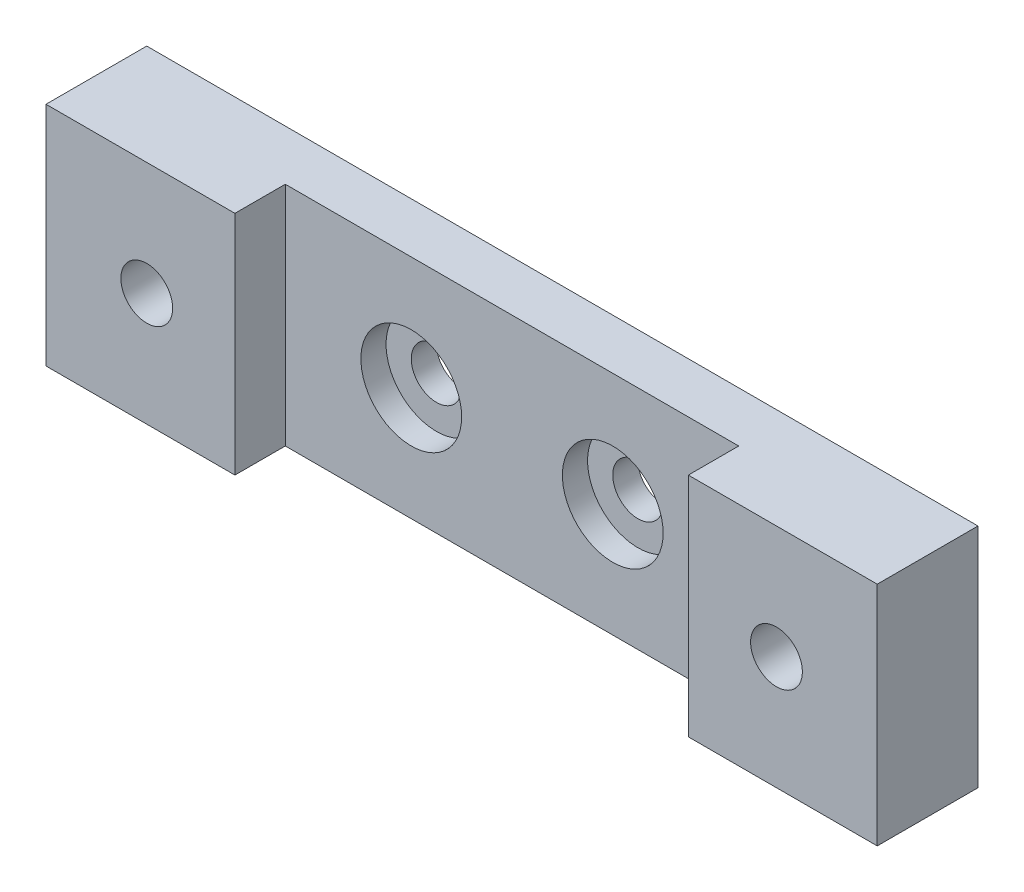
ISO-10303-21;
HEADER;
FILE_DESCRIPTION(('STEP AP214'),'2;1');
FILE_NAME('part.step','',(''),(''),'','','');
FILE_SCHEMA(('AUTOMOTIVE_DESIGN { 1 0 10303 214 1 1 1 1 }'));
ENDSEC;
DATA;
#1=APPLICATION_CONTEXT('core data for automotive mechanical design processes');
#2=APPLICATION_PROTOCOL_DEFINITION('international standard','automotive_design',2000,#1);
#3=PRODUCT_CONTEXT('',#1,'mechanical');
#4=PRODUCT('Part','Part','',(#3));
#5=PRODUCT_RELATED_PRODUCT_CATEGORY('part','',(#4));
#6=PRODUCT_DEFINITION_FORMATION('','',#4);
#7=PRODUCT_DEFINITION_CONTEXT('part definition',#1,'design');
#8=PRODUCT_DEFINITION('design','',#6,#7);
#9=PRODUCT_DEFINITION_SHAPE('','',#8);
#10=(LENGTH_UNIT() NAMED_UNIT(*) SI_UNIT(.MILLI.,.METRE.));
#11=(NAMED_UNIT(*) PLANE_ANGLE_UNIT() SI_UNIT($,.RADIAN.));
#12=(NAMED_UNIT(*) SI_UNIT($,.STERADIAN.) SOLID_ANGLE_UNIT());
#13=UNCERTAINTY_MEASURE_WITH_UNIT(LENGTH_MEASURE(1.E-05),#10,'distance_accuracy_value','');
#14=(GEOMETRIC_REPRESENTATION_CONTEXT(3) GLOBAL_UNCERTAINTY_ASSIGNED_CONTEXT((#13)) GLOBAL_UNIT_ASSIGNED_CONTEXT((#10,
#11,#12)) REPRESENTATION_CONTEXT('',''));
#15=CARTESIAN_POINT('',(0.,0.,0.));
#16=DIRECTION('',(0.,0.,1.));
#17=DIRECTION('',(1.,0.,0.));
#18=AXIS2_PLACEMENT_3D('',#15,#16,#17);
#19=CARTESIAN_POINT('',(-52.3875,28.575,12.7));
#20=DIRECTION('',(1.,0.,0.));
#21=DIRECTION('',(0.,0.,-1.));
#22=AXIS2_PLACEMENT_3D('',#19,#20,#21);
#23=PLANE('',#22);
#24=DIRECTION('',(0.,0.,1.));
#25=VECTOR('',#24,1.);
#26=CARTESIAN_POINT('',(-52.3875,0.,12.7));
#27=LINE('',#26,#25);
#28=CARTESIAN_POINT('',(-52.3875,0.,0.));
#29=VERTEX_POINT('',#28);
#30=CARTESIAN_POINT('',(-52.3875,0.,12.7));
#31=VERTEX_POINT('',#30);
#32=EDGE_CURVE('E130',#29,#31,#27,.T.);
#33=ORIENTED_EDGE('',*,*,#32,.T.);
#34=DIRECTION('',(0.,-1.,0.));
#35=VECTOR('',#34,1.);
#36=CARTESIAN_POINT('',(-52.3875,28.575,12.7));
#37=LINE('',#36,#35);
#38=CARTESIAN_POINT('',(-52.3875,28.575,12.7));
#39=VERTEX_POINT('',#38);
#40=EDGE_CURVE('E11',#39,#31,#37,.T.);
#41=ORIENTED_EDGE('',*,*,#40,.F.);
#42=DIRECTION('',(0.,0.,1.));
#43=VECTOR('',#42,1.);
#44=CARTESIAN_POINT('',(-52.3875,28.575,12.7));
#45=LINE('',#44,#43);
#46=CARTESIAN_POINT('',(-52.3875,28.575,0.));
#47=VERTEX_POINT('',#46);
#48=EDGE_CURVE('E145',#47,#39,#45,.T.);
#49=ORIENTED_EDGE('',*,*,#48,.F.);
#50=DIRECTION('',(0.,-1.,0.));
#51=VECTOR('',#50,1.);
#52=CARTESIAN_POINT('',(-52.3875,28.575,0.));
#53=LINE('',#52,#51);
#54=EDGE_CURVE('E126',#47,#29,#53,.T.);
#55=ORIENTED_EDGE('',*,*,#54,.T.);
#56=EDGE_LOOP('',(#33,#41,#49,#55));
#57=FACE_BOUND('',#56,.T.);
#58=ADVANCED_FACE('F34',(#57),#23,.F.);
#59=CARTESIAN_POINT('',(-28.575,28.575,12.7));
#60=DIRECTION('',(0.,0.,-1.));
#61=DIRECTION('',(-1.,0.,0.));
#62=AXIS2_PLACEMENT_3D('',#59,#60,#61);
#63=PLANE('',#62);
#64=CARTESIAN_POINT('',(-39.6875,14.2875,12.7));
#65=DIRECTION('',(0.,0.,1.));
#66=DIRECTION('',(1.,0.,0.));
#67=AXIS2_PLACEMENT_3D('',#64,#65,#66);
#68=CIRCLE('',#67,3.2639);
#69=CARTESIAN_POINT('',(-36.4236,14.2875,12.7));
#70=VERTEX_POINT('',#69);
#71=EDGE_CURVE('E210',#70,#70,#68,.T.);
#72=ORIENTED_EDGE('',*,*,#71,.F.);
#73=EDGE_LOOP('',(#72));
#74=FACE_BOUND('',#73,.T.);
#75=DIRECTION('',(1.,0.,0.));
#76=VECTOR('',#75,1.);
#77=CARTESIAN_POINT('',(-28.575,0.,12.7));
#78=LINE('',#77,#76);
#79=CARTESIAN_POINT('',(-28.575,0.,12.7));
#80=VERTEX_POINT('',#79);
#81=EDGE_CURVE('E133',#31,#80,#78,.T.);
#82=ORIENTED_EDGE('',*,*,#81,.T.);
#83=DIRECTION('',(0.,-1.,0.));
#84=VECTOR('',#83,1.);
#85=CARTESIAN_POINT('',(-28.575,28.575,12.7));
#86=LINE('',#85,#84);
#87=CARTESIAN_POINT('',(-28.575,28.575,12.7));
#88=VERTEX_POINT('',#87);
#89=EDGE_CURVE('E42',#88,#80,#86,.T.);
#90=ORIENTED_EDGE('',*,*,#89,.F.);
#91=DIRECTION('',(1.,0.,0.));
#92=VECTOR('',#91,1.);
#93=CARTESIAN_POINT('',(-28.575,28.575,12.7));
#94=LINE('',#93,#92);
#95=EDGE_CURVE('E93',#39,#88,#94,.T.);
#96=ORIENTED_EDGE('',*,*,#95,.F.);
#97=ORIENTED_EDGE('',*,*,#40,.T.);
#98=EDGE_LOOP('',(#82,#90,#96,#97));
#99=FACE_BOUND('',#98,.T.);
#100=ADVANCED_FACE('F216',(#74,#99),#63,.F.);
#101=CARTESIAN_POINT('',(-28.575,28.575,6.35000000000001));
#102=DIRECTION('',(-1.,0.,0.));
#103=DIRECTION('',(0.,0.,1.));
#104=AXIS2_PLACEMENT_3D('',#101,#102,#103);
#105=PLANE('',#104);
#106=DIRECTION('',(0.,0.,-1.));
#107=VECTOR('',#106,1.);
#108=CARTESIAN_POINT('',(-28.575,0.,6.35000000000001));
#109=LINE('',#108,#107);
#110=CARTESIAN_POINT('',(-28.575,0.,6.35000000000001));
#111=VERTEX_POINT('',#110);
#112=EDGE_CURVE('E136',#80,#111,#109,.T.);
#113=ORIENTED_EDGE('',*,*,#112,.T.);
#114=DIRECTION('',(0.,-1.,0.));
#115=VECTOR('',#114,1.);
#116=CARTESIAN_POINT('',(-28.575,28.575,6.35000000000001));
#117=LINE('',#116,#115);
#118=CARTESIAN_POINT('',(-28.575,28.575,6.35000000000001));
#119=VERTEX_POINT('',#118);
#120=EDGE_CURVE('E152',#119,#111,#117,.T.);
#121=ORIENTED_EDGE('',*,*,#120,.F.);
#122=DIRECTION('',(0.,0.,-1.));
#123=VECTOR('',#122,1.);
#124=CARTESIAN_POINT('',(-28.575,28.575,6.35000000000001));
#125=LINE('',#124,#123);
#126=EDGE_CURVE('E160',#88,#119,#125,.T.);
#127=ORIENTED_EDGE('',*,*,#126,.F.);
#128=ORIENTED_EDGE('',*,*,#89,.T.);
#129=EDGE_LOOP('',(#113,#121,#127,#128));
#130=FACE_BOUND('',#129,.T.);
#131=ADVANCED_FACE('F158',(#130),#105,.F.);
#132=CARTESIAN_POINT('',(28.575,28.575,6.35000000000001));
#133=DIRECTION('',(0.,0.,-1.));
#134=DIRECTION('',(-1.,0.,0.));
#135=AXIS2_PLACEMENT_3D('',#132,#133,#134);
#136=PLANE('',#135);
#137=CARTESIAN_POINT('',(12.7,14.2875,6.35000000000001));
#138=DIRECTION('',(0.,0.,1.));
#139=DIRECTION('',(1.,0.,0.));
#140=AXIS2_PLACEMENT_3D('',#137,#138,#139);
#141=CIRCLE('',#140,6.35);
#142=CARTESIAN_POINT('',(19.05,14.2875,6.35000000000001));
#143=VERTEX_POINT('',#142);
#144=EDGE_CURVE('E198',#143,#143,#141,.T.);
#145=ORIENTED_EDGE('',*,*,#144,.F.);
#146=EDGE_LOOP('',(#145));
#147=FACE_BOUND('',#146,.T.);
#148=CARTESIAN_POINT('',(-12.7,14.2875,6.35000000000001));
#149=DIRECTION('',(0.,0.,1.));
#150=DIRECTION('',(1.,0.,0.));
#151=AXIS2_PLACEMENT_3D('',#148,#149,#150);
#152=CIRCLE('',#151,6.35);
#153=CARTESIAN_POINT('',(-6.35,14.2875,6.35000000000001));
#154=VERTEX_POINT('',#153);
#155=EDGE_CURVE('E186',#154,#154,#152,.T.);
#156=ORIENTED_EDGE('',*,*,#155,.F.);
#157=EDGE_LOOP('',(#156));
#158=FACE_BOUND('',#157,.T.);
#159=DIRECTION('',(1.,0.,0.));
#160=VECTOR('',#159,1.);
#161=CARTESIAN_POINT('',(28.575,0.,6.35000000000001));
#162=LINE('',#161,#160);
#163=CARTESIAN_POINT('',(28.575,0.,6.35000000000001));
#164=VERTEX_POINT('',#163);
#165=EDGE_CURVE('E138',#111,#164,#162,.T.);
#166=ORIENTED_EDGE('',*,*,#165,.T.);
#167=DIRECTION('',(0.,-1.,0.));
#168=VECTOR('',#167,1.);
#169=CARTESIAN_POINT('',(28.575,28.575,6.35000000000001));
#170=LINE('',#169,#168);
#171=CARTESIAN_POINT('',(28.575,28.575,6.35000000000001));
#172=VERTEX_POINT('',#171);
#173=EDGE_CURVE('E149',#172,#164,#170,.T.);
#174=ORIENTED_EDGE('',*,*,#173,.F.);
#175=DIRECTION('',(1.,0.,0.));
#176=VECTOR('',#175,1.);
#177=CARTESIAN_POINT('',(28.575,28.575,6.35000000000001));
#178=LINE('',#177,#176);
#179=EDGE_CURVE('E172',#119,#172,#178,.T.);
#180=ORIENTED_EDGE('',*,*,#179,.F.);
#181=ORIENTED_EDGE('',*,*,#120,.T.);
#182=EDGE_LOOP('',(#166,#174,#180,#181));
#183=FACE_BOUND('',#182,.T.);
#184=ADVANCED_FACE('F168',(#147,#158,#183),#136,.F.);
#185=CARTESIAN_POINT('',(28.575,28.575,12.7));
#186=DIRECTION('',(1.,0.,0.));
#187=DIRECTION('',(0.,0.,-1.));
#188=AXIS2_PLACEMENT_3D('',#185,#186,#187);
#189=PLANE('',#188);
#190=DIRECTION('',(0.,0.,1.));
#191=VECTOR('',#190,1.);
#192=CARTESIAN_POINT('',(28.575,0.,12.7));
#193=LINE('',#192,#191);
#194=CARTESIAN_POINT('',(28.575,0.,12.7));
#195=VERTEX_POINT('',#194);
#196=EDGE_CURVE('E140',#164,#195,#193,.T.);
#197=ORIENTED_EDGE('',*,*,#196,.T.);
#198=DIRECTION('',(0.,-1.,0.));
#199=VECTOR('',#198,1.);
#200=CARTESIAN_POINT('',(28.575,28.575,12.7));
#201=LINE('',#200,#199);
#202=CARTESIAN_POINT('',(28.575,28.575,12.7));
#203=VERTEX_POINT('',#202);
#204=EDGE_CURVE('E121',#203,#195,#201,.T.);
#205=ORIENTED_EDGE('',*,*,#204,.F.);
#206=DIRECTION('',(0.,0.,1.));
#207=VECTOR('',#206,1.);
#208=CARTESIAN_POINT('',(28.575,28.575,12.7));
#209=LINE('',#208,#207);
#210=EDGE_CURVE('E112',#172,#203,#209,.T.);
#211=ORIENTED_EDGE('',*,*,#210,.F.);
#212=ORIENTED_EDGE('',*,*,#173,.T.);
#213=EDGE_LOOP('',(#197,#205,#211,#212));
#214=FACE_BOUND('',#213,.T.);
#215=ADVANCED_FACE('F171',(#214),#189,.F.);
#216=CARTESIAN_POINT('',(52.3875,28.575,12.7));
#217=DIRECTION('',(0.,0.,-1.));
#218=DIRECTION('',(-1.,0.,0.));
#219=AXIS2_PLACEMENT_3D('',#216,#217,#218);
#220=PLANE('',#219);
#221=CARTESIAN_POINT('',(39.6875,14.2875,12.7));
#222=DIRECTION('',(0.,0.,1.));
#223=DIRECTION('',(1.,0.,0.));
#224=AXIS2_PLACEMENT_3D('',#221,#222,#223);
#225=CIRCLE('',#224,3.2639);
#226=CARTESIAN_POINT('',(42.9514,14.2875,12.7));
#227=VERTEX_POINT('',#226);
#228=EDGE_CURVE('E204',#227,#227,#225,.T.);
#229=ORIENTED_EDGE('',*,*,#228,.F.);
#230=EDGE_LOOP('',(#229));
#231=FACE_BOUND('',#230,.T.);
#232=DIRECTION('',(1.,0.,0.));
#233=VECTOR('',#232,1.);
#234=CARTESIAN_POINT('',(52.3875,0.,12.7));
#235=LINE('',#234,#233);
#236=CARTESIAN_POINT('',(52.3875,0.,12.7));
#237=VERTEX_POINT('',#236);
#238=EDGE_CURVE('E120',#195,#237,#235,.T.);
#239=ORIENTED_EDGE('',*,*,#238,.T.);
#240=DIRECTION('',(0.,-1.,0.));
#241=VECTOR('',#240,1.);
#242=CARTESIAN_POINT('',(52.3875,28.575,12.7));
#243=LINE('',#242,#241);
#244=CARTESIAN_POINT('',(52.3875,28.575,12.7));
#245=VERTEX_POINT('',#244);
#246=EDGE_CURVE('E117',#245,#237,#243,.T.);
#247=ORIENTED_EDGE('',*,*,#246,.F.);
#248=DIRECTION('',(1.,0.,0.));
#249=VECTOR('',#248,1.);
#250=CARTESIAN_POINT('',(52.3875,28.575,12.7));
#251=LINE('',#250,#249);
#252=EDGE_CURVE('E106',#203,#245,#251,.T.);
#253=ORIENTED_EDGE('',*,*,#252,.F.);
#254=ORIENTED_EDGE('',*,*,#204,.T.);
#255=EDGE_LOOP('',(#239,#247,#253,#254));
#256=FACE_BOUND('',#255,.T.);
#257=ADVANCED_FACE('F118',(#231,#256),#220,.F.);
#258=CARTESIAN_POINT('',(52.3875,28.575,0.));
#259=DIRECTION('',(-1.,0.,0.));
#260=DIRECTION('',(0.,0.,1.));
#261=AXIS2_PLACEMENT_3D('',#258,#259,#260);
#262=PLANE('',#261);
#263=DIRECTION('',(0.,0.,-1.));
#264=VECTOR('',#263,1.);
#265=CARTESIAN_POINT('',(52.3875,0.,0.));
#266=LINE('',#265,#264);
#267=CARTESIAN_POINT('',(52.3875,0.,0.));
#268=VERTEX_POINT('',#267);
#269=EDGE_CURVE('E79',#237,#268,#266,.T.);
#270=ORIENTED_EDGE('',*,*,#269,.T.);
#271=DIRECTION('',(0.,-1.,0.));
#272=VECTOR('',#271,1.);
#273=CARTESIAN_POINT('',(52.3875,28.575,0.));
#274=LINE('',#273,#272);
#275=CARTESIAN_POINT('',(52.3875,28.575,0.));
#276=VERTEX_POINT('',#275);
#277=EDGE_CURVE('E122',#276,#268,#274,.T.);
#278=ORIENTED_EDGE('',*,*,#277,.F.);
#279=DIRECTION('',(0.,0.,-1.));
#280=VECTOR('',#279,1.);
#281=CARTESIAN_POINT('',(52.3875,28.575,0.));
#282=LINE('',#281,#280);
#283=EDGE_CURVE('E110',#245,#276,#282,.T.);
#284=ORIENTED_EDGE('',*,*,#283,.F.);
#285=ORIENTED_EDGE('',*,*,#246,.T.);
#286=EDGE_LOOP('',(#270,#278,#284,#285));
#287=FACE_BOUND('',#286,.T.);
#288=ADVANCED_FACE('F124',(#287),#262,.F.);
#289=CARTESIAN_POINT('',(-52.3875,28.575,0.));
#290=DIRECTION('',(0.,0.,1.));
#291=DIRECTION('',(1.,0.,0.));
#292=AXIS2_PLACEMENT_3D('',#289,#290,#291);
#293=PLANE('',#292);
#294=CARTESIAN_POINT('',(-39.6875,14.2875,0.));
#295=DIRECTION('',(0.,0.,1.));
#296=DIRECTION('',(1.,0.,0.));
#297=AXIS2_PLACEMENT_3D('',#294,#295,#296);
#298=CIRCLE('',#297,3.2639);
#299=CARTESIAN_POINT('',(-36.4236,14.2875,0.));
#300=VERTEX_POINT('',#299);
#301=EDGE_CURVE('E207',#300,#300,#298,.T.);
#302=ORIENTED_EDGE('',*,*,#301,.T.);
#303=EDGE_LOOP('',(#302));
#304=FACE_BOUND('',#303,.T.);
#305=CARTESIAN_POINT('',(39.6875,14.2875,0.));
#306=DIRECTION('',(0.,0.,1.));
#307=DIRECTION('',(1.,0.,0.));
#308=AXIS2_PLACEMENT_3D('',#305,#306,#307);
#309=CIRCLE('',#308,3.2639);
#310=CARTESIAN_POINT('',(42.9514,14.2875,0.));
#311=VERTEX_POINT('',#310);
#312=EDGE_CURVE('E201',#311,#311,#309,.T.);
#313=ORIENTED_EDGE('',*,*,#312,.T.);
#314=EDGE_LOOP('',(#313));
#315=FACE_BOUND('',#314,.T.);
#316=CARTESIAN_POINT('',(12.7,14.2875,0.));
#317=DIRECTION('',(0.,0.,1.));
#318=DIRECTION('',(1.,0.,0.));
#319=AXIS2_PLACEMENT_3D('',#316,#317,#318);
#320=CIRCLE('',#319,3.175);
#321=CARTESIAN_POINT('',(15.875,14.2875,0.));
#322=VERTEX_POINT('',#321);
#323=EDGE_CURVE('E189',#322,#322,#320,.T.);
#324=ORIENTED_EDGE('',*,*,#323,.T.);
#325=EDGE_LOOP('',(#324));
#326=FACE_BOUND('',#325,.T.);
#327=CARTESIAN_POINT('',(-12.7,14.2875,0.));
#328=DIRECTION('',(0.,0.,1.));
#329=DIRECTION('',(1.,0.,0.));
#330=AXIS2_PLACEMENT_3D('',#327,#328,#329);
#331=CIRCLE('',#330,3.175);
#332=CARTESIAN_POINT('',(-9.525,14.2875,0.));
#333=VERTEX_POINT('',#332);
#334=EDGE_CURVE('E134',#333,#333,#331,.T.);
#335=ORIENTED_EDGE('',*,*,#334,.T.);
#336=EDGE_LOOP('',(#335));
#337=FACE_BOUND('',#336,.T.);
#338=DIRECTION('',(-1.,0.,0.));
#339=VECTOR('',#338,1.);
#340=CARTESIAN_POINT('',(-52.3875,0.,0.));
#341=LINE('',#340,#339);
#342=EDGE_CURVE('E85',#268,#29,#341,.T.);
#343=ORIENTED_EDGE('',*,*,#342,.T.);
#344=ORIENTED_EDGE('',*,*,#54,.F.);
#345=DIRECTION('',(-1.,0.,0.));
#346=VECTOR('',#345,1.);
#347=CARTESIAN_POINT('',(-52.3875,28.575,0.));
#348=LINE('',#347,#346);
#349=EDGE_CURVE('E50',#276,#47,#348,.T.);
#350=ORIENTED_EDGE('',*,*,#349,.F.);
#351=ORIENTED_EDGE('',*,*,#277,.T.);
#352=EDGE_LOOP('',(#343,#344,#350,#351));
#353=FACE_BOUND('',#352,.T.);
#354=ADVANCED_FACE('F221',(#304,#315,#326,#337,#353),#293,.F.);
#355=CARTESIAN_POINT('',(0.,28.575,0.));
#356=DIRECTION('',(0.,-1.,0.));
#357=DIRECTION('',(0.,0.,-1.));
#358=AXIS2_PLACEMENT_3D('',#355,#356,#357);
#359=PLANE('',#358);
#360=ORIENTED_EDGE('',*,*,#48,.T.);
#361=ORIENTED_EDGE('',*,*,#95,.T.);
#362=ORIENTED_EDGE('',*,*,#126,.T.);
#363=ORIENTED_EDGE('',*,*,#179,.T.);
#364=ORIENTED_EDGE('',*,*,#210,.T.);
#365=ORIENTED_EDGE('',*,*,#252,.T.);
#366=ORIENTED_EDGE('',*,*,#283,.T.);
#367=ORIENTED_EDGE('',*,*,#349,.T.);
#368=EDGE_LOOP('',(#360,#361,#362,#363,#364,#365,#366,#367));
#369=FACE_BOUND('',#368,.T.);
#370=ADVANCED_FACE('F108',(#369),#359,.F.);
#371=CARTESIAN_POINT('',(0.,0.,0.));
#372=DIRECTION('',(0.,-1.,0.));
#373=DIRECTION('',(0.,0.,-1.));
#374=AXIS2_PLACEMENT_3D('',#371,#372,#373);
#375=PLANE('',#374);
#376=ORIENTED_EDGE('',*,*,#32,.F.);
#377=ORIENTED_EDGE('',*,*,#342,.F.);
#378=ORIENTED_EDGE('',*,*,#269,.F.);
#379=ORIENTED_EDGE('',*,*,#238,.F.);
#380=ORIENTED_EDGE('',*,*,#196,.F.);
#381=ORIENTED_EDGE('',*,*,#165,.F.);
#382=ORIENTED_EDGE('',*,*,#112,.F.);
#383=ORIENTED_EDGE('',*,*,#81,.F.);
#384=EDGE_LOOP('',(#376,#377,#378,#379,#380,#381,#382,#383));
#385=FACE_BOUND('',#384,.T.);
#386=ADVANCED_FACE('F164',(#385),#375,.T.);
#387=CARTESIAN_POINT('',(-12.7,14.2875,6.35000000000001));
#388=DIRECTION('',(0.,0.,1.));
#389=DIRECTION('',(1.,0.,0.));
#390=AXIS2_PLACEMENT_3D('',#387,#388,#389);
#391=CYLINDRICAL_SURFACE('',#390,3.17500000000001);
#392=ORIENTED_EDGE('',*,*,#334,.F.);
#393=EDGE_LOOP('',(#392));
#394=FACE_BOUND('',#393,.T.);
#395=CARTESIAN_POINT('',(-12.7,14.2875,3.17500000000001));
#396=DIRECTION('',(0.,0.,1.));
#397=DIRECTION('',(1.,0.,0.));
#398=AXIS2_PLACEMENT_3D('',#395,#396,#397);
#399=CIRCLE('',#398,3.17500000000001);
#400=CARTESIAN_POINT('',(-9.52499999999999,14.2875,3.17500000000001));
#401=VERTEX_POINT('',#400);
#402=EDGE_CURVE('E180',#401,#401,#399,.T.);
#403=ORIENTED_EDGE('',*,*,#402,.T.);
#404=EDGE_LOOP('',(#403));
#405=FACE_BOUND('',#404,.T.);
#406=ADVANCED_FACE('F287',(#394,#405),#391,.F.);
#407=CARTESIAN_POINT('',(-9.52499999999999,14.2875,3.17500000000001));
#408=DIRECTION('',(0.,0.,-1.));
#409=DIRECTION('',(-1.,0.,0.));
#410=AXIS2_PLACEMENT_3D('',#407,#408,#409);
#411=PLANE('',#410);
#412=ORIENTED_EDGE('',*,*,#402,.F.);
#413=EDGE_LOOP('',(#412));
#414=FACE_BOUND('',#413,.T.);
#415=CARTESIAN_POINT('',(-12.7,14.2875,3.17500000000001));
#416=DIRECTION('',(0.,0.,1.));
#417=DIRECTION('',(1.,0.,0.));
#418=AXIS2_PLACEMENT_3D('',#415,#416,#417);
#419=CIRCLE('',#418,6.35);
#420=CARTESIAN_POINT('',(-6.35,14.2875,3.17500000000001));
#421=VERTEX_POINT('',#420);
#422=EDGE_CURVE('E183',#421,#421,#419,.T.);
#423=ORIENTED_EDGE('',*,*,#422,.T.);
#424=EDGE_LOOP('',(#423));
#425=FACE_BOUND('',#424,.T.);
#426=ADVANCED_FACE('F295',(#414,#425),#411,.F.);
#427=CARTESIAN_POINT('',(-12.7,14.2875,6.35000000000001));
#428=DIRECTION('',(0.,0.,1.));
#429=DIRECTION('',(1.,0.,0.));
#430=AXIS2_PLACEMENT_3D('',#427,#428,#429);
#431=CYLINDRICAL_SURFACE('',#430,6.35);
#432=ORIENTED_EDGE('',*,*,#422,.F.);
#433=EDGE_LOOP('',(#432));
#434=FACE_BOUND('',#433,.T.);
#435=ORIENTED_EDGE('',*,*,#155,.T.);
#436=EDGE_LOOP('',(#435));
#437=FACE_BOUND('',#436,.T.);
#438=ADVANCED_FACE('F302',(#434,#437),#431,.F.);
#439=CARTESIAN_POINT('',(12.7,14.2875,6.35000000000001));
#440=DIRECTION('',(0.,0.,1.));
#441=DIRECTION('',(1.,0.,0.));
#442=AXIS2_PLACEMENT_3D('',#439,#440,#441);
#443=CYLINDRICAL_SURFACE('',#442,3.17500000000001);
#444=ORIENTED_EDGE('',*,*,#323,.F.);
#445=EDGE_LOOP('',(#444));
#446=FACE_BOUND('',#445,.T.);
#447=CARTESIAN_POINT('',(12.7,14.2875,3.17500000000001));
#448=DIRECTION('',(0.,0.,1.));
#449=DIRECTION('',(1.,0.,0.));
#450=AXIS2_PLACEMENT_3D('',#447,#448,#449);
#451=CIRCLE('',#450,3.17500000000001);
#452=CARTESIAN_POINT('',(15.875,14.2875,3.17500000000001));
#453=VERTEX_POINT('',#452);
#454=EDGE_CURVE('E192',#453,#453,#451,.T.);
#455=ORIENTED_EDGE('',*,*,#454,.T.);
#456=EDGE_LOOP('',(#455));
#457=FACE_BOUND('',#456,.T.);
#458=ADVANCED_FACE('F310',(#446,#457),#443,.F.);
#459=CARTESIAN_POINT('',(15.875,14.2875,3.17500000000001));
#460=DIRECTION('',(0.,0.,-1.));
#461=DIRECTION('',(-1.,0.,0.));
#462=AXIS2_PLACEMENT_3D('',#459,#460,#461);
#463=PLANE('',#462);
#464=ORIENTED_EDGE('',*,*,#454,.F.);
#465=EDGE_LOOP('',(#464));
#466=FACE_BOUND('',#465,.T.);
#467=CARTESIAN_POINT('',(12.7,14.2875,3.17500000000001));
#468=DIRECTION('',(0.,0.,1.));
#469=DIRECTION('',(1.,0.,0.));
#470=AXIS2_PLACEMENT_3D('',#467,#468,#469);
#471=CIRCLE('',#470,6.35);
#472=CARTESIAN_POINT('',(19.05,14.2875,3.17500000000001));
#473=VERTEX_POINT('',#472);
#474=EDGE_CURVE('E195',#473,#473,#471,.T.);
#475=ORIENTED_EDGE('',*,*,#474,.T.);
#476=EDGE_LOOP('',(#475));
#477=FACE_BOUND('',#476,.T.);
#478=ADVANCED_FACE('F318',(#466,#477),#463,.F.);
#479=CARTESIAN_POINT('',(12.7,14.2875,6.35000000000001));
#480=DIRECTION('',(0.,0.,1.));
#481=DIRECTION('',(1.,0.,0.));
#482=AXIS2_PLACEMENT_3D('',#479,#480,#481);
#483=CYLINDRICAL_SURFACE('',#482,6.35);
#484=ORIENTED_EDGE('',*,*,#474,.F.);
#485=EDGE_LOOP('',(#484));
#486=FACE_BOUND('',#485,.T.);
#487=ORIENTED_EDGE('',*,*,#144,.T.);
#488=EDGE_LOOP('',(#487));
#489=FACE_BOUND('',#488,.T.);
#490=ADVANCED_FACE('F326',(#486,#489),#483,.F.);
#491=CARTESIAN_POINT('',(39.6875,14.2875,12.7));
#492=DIRECTION('',(0.,0.,1.));
#493=DIRECTION('',(1.,0.,0.));
#494=AXIS2_PLACEMENT_3D('',#491,#492,#493);
#495=CYLINDRICAL_SURFACE('',#494,3.2639);
#496=ORIENTED_EDGE('',*,*,#312,.F.);
#497=EDGE_LOOP('',(#496));
#498=FACE_BOUND('',#497,.T.);
#499=ORIENTED_EDGE('',*,*,#228,.T.);
#500=EDGE_LOOP('',(#499));
#501=FACE_BOUND('',#500,.T.);
#502=ADVANCED_FACE('F333',(#498,#501),#495,.F.);
#503=CARTESIAN_POINT('',(-39.6875,14.2875,12.7));
#504=DIRECTION('',(0.,0.,1.));
#505=DIRECTION('',(1.,0.,0.));
#506=AXIS2_PLACEMENT_3D('',#503,#504,#505);
#507=CYLINDRICAL_SURFACE('',#506,3.2639);
#508=ORIENTED_EDGE('',*,*,#301,.F.);
#509=EDGE_LOOP('',(#508));
#510=FACE_BOUND('',#509,.T.);
#511=ORIENTED_EDGE('',*,*,#71,.T.);
#512=EDGE_LOOP('',(#511));
#513=FACE_BOUND('',#512,.T.);
#514=ADVANCED_FACE('F214',(#510,#513),#507,.F.);
#515=CLOSED_SHELL('',(#58,#100,#131,#184,#215,#257,#288,#354,#370,#386,#406,#426,#438,#458,#478,
#490,#502,#514));
#516=MANIFOLD_SOLID_BREP('B2',#515);
#517=ADVANCED_BREP_SHAPE_REPRESENTATION('',(#18,#516),#14);
#518=SHAPE_DEFINITION_REPRESENTATION(#9,#517);
ENDSEC;
END-ISO-10303-21;
